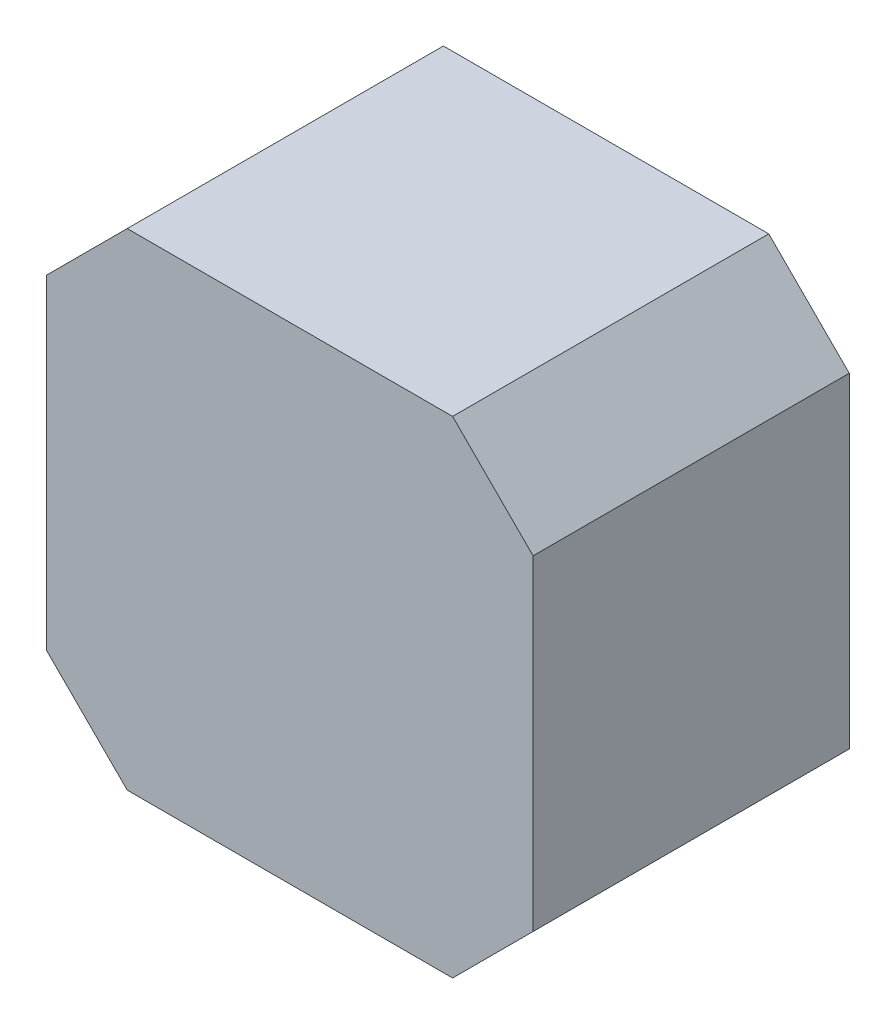
ISO-10303-21;
HEADER;
FILE_DESCRIPTION(('STEP AP214'),'2;1');
FILE_NAME('part.step','',(''),(''),'','','');
FILE_SCHEMA(('AUTOMOTIVE_DESIGN { 1 0 10303 214 1 1 1 1 }'));
ENDSEC;
DATA;
#1=APPLICATION_CONTEXT('core data for automotive mechanical design processes');
#2=APPLICATION_PROTOCOL_DEFINITION('international standard','automotive_design',2000,#1);
#3=PRODUCT_CONTEXT('',#1,'mechanical');
#4=PRODUCT('Part','Part','',(#3));
#5=PRODUCT_RELATED_PRODUCT_CATEGORY('part','',(#4));
#6=PRODUCT_DEFINITION_FORMATION('','',#4);
#7=PRODUCT_DEFINITION_CONTEXT('part definition',#1,'design');
#8=PRODUCT_DEFINITION('design','',#6,#7);
#9=PRODUCT_DEFINITION_SHAPE('','',#8);
#10=(LENGTH_UNIT() NAMED_UNIT(*) SI_UNIT(.MILLI.,.METRE.));
#11=(NAMED_UNIT(*) PLANE_ANGLE_UNIT() SI_UNIT($,.RADIAN.));
#12=(NAMED_UNIT(*) SI_UNIT($,.STERADIAN.) SOLID_ANGLE_UNIT());
#13=UNCERTAINTY_MEASURE_WITH_UNIT(LENGTH_MEASURE(1.E-05),#10,'distance_accuracy_value','');
#14=(GEOMETRIC_REPRESENTATION_CONTEXT(3) GLOBAL_UNCERTAINTY_ASSIGNED_CONTEXT((#13)) GLOBAL_UNIT_ASSIGNED_CONTEXT((#10,
#11,#12)) REPRESENTATION_CONTEXT('',''));
#15=CARTESIAN_POINT('',(0.,0.,0.));
#16=DIRECTION('',(0.,0.,1.));
#17=DIRECTION('',(1.,0.,0.));
#18=AXIS2_PLACEMENT_3D('',#15,#16,#17);
#19=CARTESIAN_POINT('',(-21.15,14.15,-27.5));
#20=DIRECTION('',(1.,0.,0.));
#21=DIRECTION('',(0.,0.,1.));
#22=AXIS2_PLACEMENT_3D('',#19,#20,#21);
#23=PLANE('',#22);
#24=DIRECTION('',(0.,-1.,0.));
#25=VECTOR('',#24,1.);
#26=CARTESIAN_POINT('',(-21.15,14.15,0.));
#27=LINE('',#26,#25);
#28=CARTESIAN_POINT('',(-21.15,14.15,0.));
#29=VERTEX_POINT('',#28);
#30=CARTESIAN_POINT('',(-21.15,-14.15,0.));
#31=VERTEX_POINT('',#30);
#32=EDGE_CURVE('E133',#29,#31,#27,.T.);
#33=ORIENTED_EDGE('',*,*,#32,.F.);
#34=DIRECTION('',(0.,0.,1.));
#35=VECTOR('',#34,1.);
#36=CARTESIAN_POINT('',(-21.15,14.15,-27.5));
#37=LINE('',#36,#35);
#38=CARTESIAN_POINT('',(-21.15,14.15,-27.5));
#39=VERTEX_POINT('',#38);
#40=EDGE_CURVE('E132',#39,#29,#37,.T.);
#41=ORIENTED_EDGE('',*,*,#40,.F.);
#42=DIRECTION('',(0.,-1.,0.));
#43=VECTOR('',#42,1.);
#44=CARTESIAN_POINT('',(-21.15,14.15,-27.5));
#45=LINE('',#44,#43);
#46=CARTESIAN_POINT('',(-21.15,-14.15,-27.5));
#47=VERTEX_POINT('',#46);
#48=EDGE_CURVE('E151',#39,#47,#45,.T.);
#49=ORIENTED_EDGE('',*,*,#48,.T.);
#50=DIRECTION('',(0.,0.,1.));
#51=VECTOR('',#50,1.);
#52=CARTESIAN_POINT('',(-21.15,-14.15,-27.5));
#53=LINE('',#52,#51);
#54=EDGE_CURVE('E11',#47,#31,#53,.T.);
#55=ORIENTED_EDGE('',*,*,#54,.T.);
#56=EDGE_LOOP('',(#33,#41,#49,#55));
#57=FACE_BOUND('',#56,.T.);
#58=ADVANCED_FACE('F37',(#57),#23,.F.);
#59=CARTESIAN_POINT('',(-21.15,-14.15,-27.5));
#60=DIRECTION('',(0.707106781186547,0.707106781186547,0.));
#61=DIRECTION('',(-0.707106781186548,0.707106781186548,0.));
#62=AXIS2_PLACEMENT_3D('',#59,#60,#61);
#63=PLANE('',#62);
#64=DIRECTION('',(0.707106781186547,-0.707106781186547,0.));
#65=VECTOR('',#64,1.);
#66=CARTESIAN_POINT('',(-21.15,-14.15,0.));
#67=LINE('',#66,#65);
#68=CARTESIAN_POINT('',(-14.15,-21.15,0.));
#69=VERTEX_POINT('',#68);
#70=EDGE_CURVE('E135',#31,#69,#67,.T.);
#71=ORIENTED_EDGE('',*,*,#70,.F.);
#72=ORIENTED_EDGE('',*,*,#54,.F.);
#73=DIRECTION('',(0.707106781186547,-0.707106781186547,0.));
#74=VECTOR('',#73,1.);
#75=CARTESIAN_POINT('',(-21.15,-14.15,-27.5));
#76=LINE('',#75,#74);
#77=CARTESIAN_POINT('',(-14.15,-21.15,-27.5));
#78=VERTEX_POINT('',#77);
#79=EDGE_CURVE('E91',#47,#78,#76,.T.);
#80=ORIENTED_EDGE('',*,*,#79,.T.);
#81=DIRECTION('',(0.,0.,1.));
#82=VECTOR('',#81,1.);
#83=CARTESIAN_POINT('',(-14.15,-21.15,-27.5));
#84=LINE('',#83,#82);
#85=EDGE_CURVE('E45',#78,#69,#84,.T.);
#86=ORIENTED_EDGE('',*,*,#85,.T.);
#87=EDGE_LOOP('',(#71,#72,#80,#86));
#88=FACE_BOUND('',#87,.T.);
#89=ADVANCED_FACE('F163',(#88),#63,.F.);
#90=CARTESIAN_POINT('',(-14.15,-21.15,-27.5));
#91=DIRECTION('',(0.,1.,0.));
#92=DIRECTION('',(0.,0.,-1.));
#93=AXIS2_PLACEMENT_3D('',#90,#91,#92);
#94=PLANE('',#93);
#95=DIRECTION('',(1.,0.,0.));
#96=VECTOR('',#95,1.);
#97=CARTESIAN_POINT('',(-14.15,-21.15,0.));
#98=LINE('',#97,#96);
#99=CARTESIAN_POINT('',(14.15,-21.15,0.));
#100=VERTEX_POINT('',#99);
#101=EDGE_CURVE('E138',#69,#100,#98,.T.);
#102=ORIENTED_EDGE('',*,*,#101,.F.);
#103=ORIENTED_EDGE('',*,*,#85,.F.);
#104=DIRECTION('',(1.,0.,0.));
#105=VECTOR('',#104,1.);
#106=CARTESIAN_POINT('',(-14.15,-21.15,-27.5));
#107=LINE('',#106,#105);
#108=CARTESIAN_POINT('',(14.15,-21.15,-27.5));
#109=VERTEX_POINT('',#108);
#110=EDGE_CURVE('E172',#78,#109,#107,.T.);
#111=ORIENTED_EDGE('',*,*,#110,.T.);
#112=DIRECTION('',(0.,0.,1.));
#113=VECTOR('',#112,1.);
#114=CARTESIAN_POINT('',(14.15,-21.15,-27.5));
#115=LINE('',#114,#113);
#116=EDGE_CURVE('E158',#109,#100,#115,.T.);
#117=ORIENTED_EDGE('',*,*,#116,.T.);
#118=EDGE_LOOP('',(#102,#103,#111,#117));
#119=FACE_BOUND('',#118,.T.);
#120=ADVANCED_FACE('F182',(#119),#94,.F.);
#121=CARTESIAN_POINT('',(21.15,-14.15,-27.5));
#122=DIRECTION('',(-0.707106781186547,0.707106781186547,0.));
#123=DIRECTION('',(-0.707106781186548,-0.707106781186548,0.));
#124=AXIS2_PLACEMENT_3D('',#121,#122,#123);
#125=PLANE('',#124);
#126=DIRECTION('',(0.707106781186547,0.707106781186547,0.));
#127=VECTOR('',#126,1.);
#128=CARTESIAN_POINT('',(21.15,-14.15,0.));
#129=LINE('',#128,#127);
#130=CARTESIAN_POINT('',(21.15,-14.15,0.));
#131=VERTEX_POINT('',#130);
#132=EDGE_CURVE('E141',#100,#131,#129,.T.);
#133=ORIENTED_EDGE('',*,*,#132,.F.);
#134=ORIENTED_EDGE('',*,*,#116,.F.);
#135=DIRECTION('',(0.707106781186547,0.707106781186547,0.));
#136=VECTOR('',#135,1.);
#137=CARTESIAN_POINT('',(21.15,-14.15,-27.5));
#138=LINE('',#137,#136);
#139=CARTESIAN_POINT('',(21.15,-14.15,-27.5));
#140=VERTEX_POINT('',#139);
#141=EDGE_CURVE('E127',#109,#140,#138,.T.);
#142=ORIENTED_EDGE('',*,*,#141,.T.);
#143=DIRECTION('',(0.,0.,1.));
#144=VECTOR('',#143,1.);
#145=CARTESIAN_POINT('',(21.15,-14.15,-27.5));
#146=LINE('',#145,#144);
#147=EDGE_CURVE('E155',#140,#131,#146,.T.);
#148=ORIENTED_EDGE('',*,*,#147,.T.);
#149=EDGE_LOOP('',(#133,#134,#142,#148));
#150=FACE_BOUND('',#149,.T.);
#151=ADVANCED_FACE('F178',(#150),#125,.F.);
#152=CARTESIAN_POINT('',(21.15,14.15,-27.5));
#153=DIRECTION('',(-1.,0.,0.));
#154=DIRECTION('',(0.,-1.,0.));
#155=AXIS2_PLACEMENT_3D('',#152,#153,#154);
#156=PLANE('',#155);
#157=DIRECTION('',(0.,1.,0.));
#158=VECTOR('',#157,1.);
#159=CARTESIAN_POINT('',(21.15,14.15,0.));
#160=LINE('',#159,#158);
#161=CARTESIAN_POINT('',(21.15,14.15,0.));
#162=VERTEX_POINT('',#161);
#163=EDGE_CURVE('E144',#131,#162,#160,.T.);
#164=ORIENTED_EDGE('',*,*,#163,.F.);
#165=ORIENTED_EDGE('',*,*,#147,.F.);
#166=DIRECTION('',(0.,1.,0.));
#167=VECTOR('',#166,1.);
#168=CARTESIAN_POINT('',(21.15,14.15,-27.5));
#169=LINE('',#168,#167);
#170=CARTESIAN_POINT('',(21.15,14.15,-27.5));
#171=VERTEX_POINT('',#170);
#172=EDGE_CURVE('E125',#140,#171,#169,.T.);
#173=ORIENTED_EDGE('',*,*,#172,.T.);
#174=DIRECTION('',(0.,0.,1.));
#175=VECTOR('',#174,1.);
#176=CARTESIAN_POINT('',(21.15,14.15,-27.5));
#177=LINE('',#176,#175);
#178=EDGE_CURVE('E119',#171,#162,#177,.T.);
#179=ORIENTED_EDGE('',*,*,#178,.T.);
#180=EDGE_LOOP('',(#164,#165,#173,#179));
#181=FACE_BOUND('',#180,.T.);
#182=ADVANCED_FACE('F181',(#181),#156,.F.);
#183=CARTESIAN_POINT('',(14.15,21.15,-27.5));
#184=DIRECTION('',(-0.707106781186547,-0.707106781186547,0.));
#185=DIRECTION('',(0.707106781186548,-0.707106781186548,0.));
#186=AXIS2_PLACEMENT_3D('',#183,#184,#185);
#187=PLANE('',#186);
#188=DIRECTION('',(-0.707106781186547,0.707106781186547,0.));
#189=VECTOR('',#188,1.);
#190=CARTESIAN_POINT('',(14.15,21.15,0.));
#191=LINE('',#190,#189);
#192=CARTESIAN_POINT('',(14.15,21.15,0.));
#193=VERTEX_POINT('',#192);
#194=EDGE_CURVE('E147',#162,#193,#191,.T.);
#195=ORIENTED_EDGE('',*,*,#194,.F.);
#196=ORIENTED_EDGE('',*,*,#178,.F.);
#197=DIRECTION('',(-0.707106781186547,0.707106781186547,0.));
#198=VECTOR('',#197,1.);
#199=CARTESIAN_POINT('',(14.15,21.15,-27.5));
#200=LINE('',#199,#198);
#201=CARTESIAN_POINT('',(14.15,21.15,-27.5));
#202=VERTEX_POINT('',#201);
#203=EDGE_CURVE('E109',#171,#202,#200,.T.);
#204=ORIENTED_EDGE('',*,*,#203,.T.);
#205=DIRECTION('',(0.,0.,1.));
#206=VECTOR('',#205,1.);
#207=CARTESIAN_POINT('',(14.15,21.15,-27.5));
#208=LINE('',#207,#206);
#209=EDGE_CURVE('E114',#202,#193,#208,.T.);
#210=ORIENTED_EDGE('',*,*,#209,.T.);
#211=EDGE_LOOP('',(#195,#196,#204,#210));
#212=FACE_BOUND('',#211,.T.);
#213=ADVANCED_FACE('F122',(#212),#187,.F.);
#214=CARTESIAN_POINT('',(-14.15,21.15,-27.5));
#215=DIRECTION('',(0.,-1.,0.));
#216=DIRECTION('',(0.,0.,1.));
#217=AXIS2_PLACEMENT_3D('',#214,#215,#216);
#218=PLANE('',#217);
#219=DIRECTION('',(-1.,0.,0.));
#220=VECTOR('',#219,1.);
#221=CARTESIAN_POINT('',(-14.15,21.15,0.));
#222=LINE('',#221,#220);
#223=CARTESIAN_POINT('',(-14.15,21.15,0.));
#224=VERTEX_POINT('',#223);
#225=EDGE_CURVE('E116',#193,#224,#222,.T.);
#226=ORIENTED_EDGE('',*,*,#225,.F.);
#227=ORIENTED_EDGE('',*,*,#209,.F.);
#228=DIRECTION('',(-1.,0.,0.));
#229=VECTOR('',#228,1.);
#230=CARTESIAN_POINT('',(-14.15,21.15,-27.5));
#231=LINE('',#230,#229);
#232=CARTESIAN_POINT('',(-14.15,21.15,-27.5));
#233=VERTEX_POINT('',#232);
#234=EDGE_CURVE('E105',#202,#233,#231,.T.);
#235=ORIENTED_EDGE('',*,*,#234,.T.);
#236=DIRECTION('',(0.,0.,1.));
#237=VECTOR('',#236,1.);
#238=CARTESIAN_POINT('',(-14.15,21.15,-27.5));
#239=LINE('',#238,#237);
#240=EDGE_CURVE('E120',#233,#224,#239,.T.);
#241=ORIENTED_EDGE('',*,*,#240,.T.);
#242=EDGE_LOOP('',(#226,#227,#235,#241));
#243=FACE_BOUND('',#242,.T.);
#244=ADVANCED_FACE('F115',(#243),#218,.F.);
#245=CARTESIAN_POINT('',(-14.15,21.15,-27.5));
#246=DIRECTION('',(0.707106781186547,-0.707106781186547,0.));
#247=DIRECTION('',(0.707106781186548,0.707106781186548,0.));
#248=AXIS2_PLACEMENT_3D('',#245,#246,#247);
#249=PLANE('',#248);
#250=DIRECTION('',(-0.707106781186547,-0.707106781186547,0.));
#251=VECTOR('',#250,1.);
#252=CARTESIAN_POINT('',(-14.15,21.15,0.));
#253=LINE('',#252,#251);
#254=EDGE_CURVE('E79',#224,#29,#253,.T.);
#255=ORIENTED_EDGE('',*,*,#254,.F.);
#256=ORIENTED_EDGE('',*,*,#240,.F.);
#257=DIRECTION('',(-0.707106781186547,-0.707106781186547,0.));
#258=VECTOR('',#257,1.);
#259=CARTESIAN_POINT('',(-14.15,21.15,-27.5));
#260=LINE('',#259,#258);
#261=EDGE_CURVE('E53',#233,#39,#260,.T.);
#262=ORIENTED_EDGE('',*,*,#261,.T.);
#263=ORIENTED_EDGE('',*,*,#40,.T.);
#264=EDGE_LOOP('',(#255,#256,#262,#263));
#265=FACE_BOUND('',#264,.T.);
#266=ADVANCED_FACE('F230',(#265),#249,.F.);
#267=CARTESIAN_POINT('',(0.,0.,-27.5));
#268=DIRECTION('',(0.,0.,-1.));
#269=DIRECTION('',(1.,0.,0.));
#270=AXIS2_PLACEMENT_3D('',#267,#268,#269);
#271=PLANE('',#270);
#272=ORIENTED_EDGE('',*,*,#48,.F.);
#273=ORIENTED_EDGE('',*,*,#261,.F.);
#274=ORIENTED_EDGE('',*,*,#234,.F.);
#275=ORIENTED_EDGE('',*,*,#203,.F.);
#276=ORIENTED_EDGE('',*,*,#172,.F.);
#277=ORIENTED_EDGE('',*,*,#141,.F.);
#278=ORIENTED_EDGE('',*,*,#110,.F.);
#279=ORIENTED_EDGE('',*,*,#79,.F.);
#280=EDGE_LOOP('',(#272,#273,#274,#275,#276,#277,#278,#279));
#281=FACE_BOUND('',#280,.T.);
#282=ADVANCED_FACE('F107',(#281),#271,.T.);
#283=CARTESIAN_POINT('',(0.,0.,0.));
#284=DIRECTION('',(0.,0.,-1.));
#285=DIRECTION('',(1.,0.,0.));
#286=AXIS2_PLACEMENT_3D('',#283,#284,#285);
#287=PLANE('',#286);
#288=ORIENTED_EDGE('',*,*,#32,.T.);
#289=ORIENTED_EDGE('',*,*,#70,.T.);
#290=ORIENTED_EDGE('',*,*,#101,.T.);
#291=ORIENTED_EDGE('',*,*,#132,.T.);
#292=ORIENTED_EDGE('',*,*,#163,.T.);
#293=ORIENTED_EDGE('',*,*,#194,.T.);
#294=ORIENTED_EDGE('',*,*,#225,.T.);
#295=ORIENTED_EDGE('',*,*,#254,.T.);
#296=EDGE_LOOP('',(#288,#289,#290,#291,#292,#293,#294,#295));
#297=FACE_BOUND('',#296,.T.);
#298=ADVANCED_FACE('F166',(#297),#287,.F.);
#299=CLOSED_SHELL('',(#58,#89,#120,#151,#182,#213,#244,#266,#282,#298));
#300=MANIFOLD_SOLID_BREP('B2',#299);
#301=ADVANCED_BREP_SHAPE_REPRESENTATION('',(#18,#300),#14);
#302=SHAPE_DEFINITION_REPRESENTATION(#9,#301);
ENDSEC;
END-ISO-10303-21;
